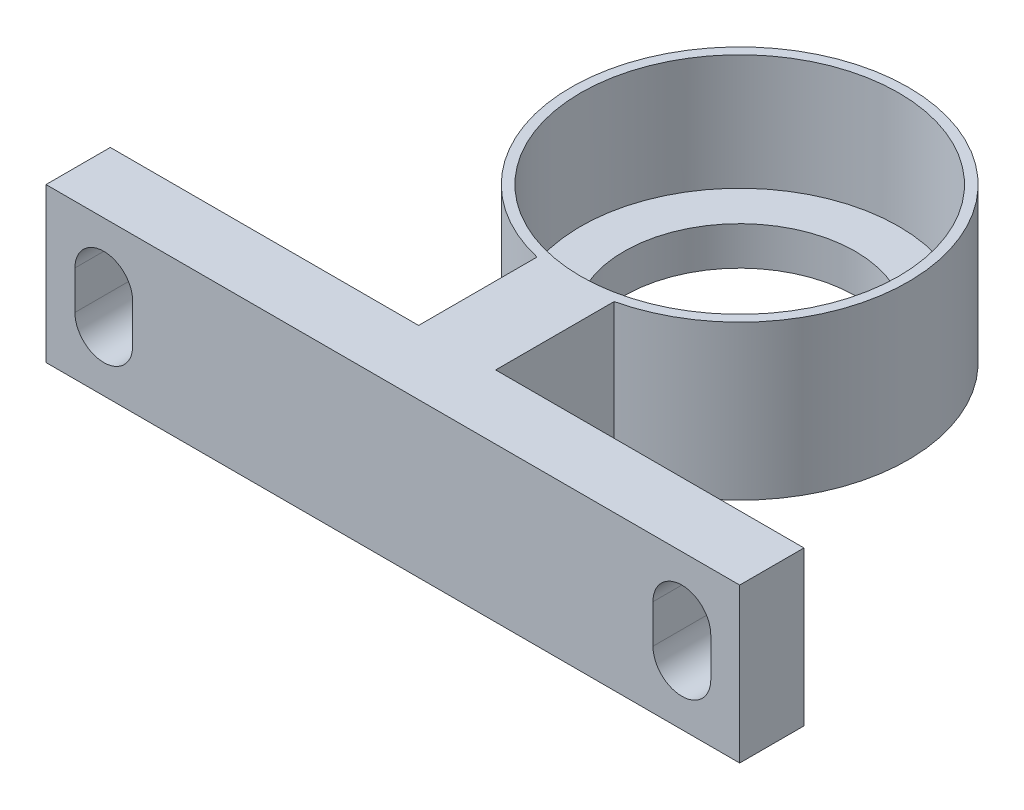
ISO-10303-21;
HEADER;
FILE_DESCRIPTION(('STEP AP214'),'2;1');
FILE_NAME('part.step','',(''),(''),'','','');
FILE_SCHEMA(('AUTOMOTIVE_DESIGN { 1 0 10303 214 1 1 1 1 }'));
ENDSEC;
DATA;
#1=APPLICATION_CONTEXT('core data for automotive mechanical design processes');
#2=APPLICATION_PROTOCOL_DEFINITION('international standard','automotive_design',2000,#1);
#3=PRODUCT_CONTEXT('',#1,'mechanical');
#4=PRODUCT('Part','Part','',(#3));
#5=PRODUCT_RELATED_PRODUCT_CATEGORY('part','',(#4));
#6=PRODUCT_DEFINITION_FORMATION('','',#4);
#7=PRODUCT_DEFINITION_CONTEXT('part definition',#1,'design');
#8=PRODUCT_DEFINITION('design','',#6,#7);
#9=PRODUCT_DEFINITION_SHAPE('','',#8);
#10=(LENGTH_UNIT() NAMED_UNIT(*) SI_UNIT(.MILLI.,.METRE.));
#11=(NAMED_UNIT(*) PLANE_ANGLE_UNIT() SI_UNIT($,.RADIAN.));
#12=(NAMED_UNIT(*) SI_UNIT($,.STERADIAN.) SOLID_ANGLE_UNIT());
#13=UNCERTAINTY_MEASURE_WITH_UNIT(LENGTH_MEASURE(1.E-05),#10,'distance_accuracy_value','');
#14=(GEOMETRIC_REPRESENTATION_CONTEXT(3) GLOBAL_UNCERTAINTY_ASSIGNED_CONTEXT((#13)) GLOBAL_UNIT_ASSIGNED_CONTEXT((#10,
#11,#12)) REPRESENTATION_CONTEXT('',''));
#15=CARTESIAN_POINT('',(0.,0.,0.));
#16=DIRECTION('',(0.,0.,1.));
#17=DIRECTION('',(1.,0.,0.));
#18=AXIS2_PLACEMENT_3D('',#15,#16,#17);
#19=CARTESIAN_POINT('',(27.1849545327589,8.,0.));
#20=DIRECTION('',(0.,-1.,0.));
#21=DIRECTION('',(0.,0.,-1.));
#22=AXIS2_PLACEMENT_3D('',#19,#20,#21);
#23=CYLINDRICAL_SURFACE('',#22,8.75);
#24=DIRECTION('',(0.,-1.,0.));
#25=VECTOR('',#24,1.);
#26=CARTESIAN_POINT('',(29.1849545327589,8.,8.51836251870042));
#27=LINE('',#26,#25);
#28=CARTESIAN_POINT('',(29.1849545327589,8.,8.51836251870042));
#29=VERTEX_POINT('',#28);
#30=CARTESIAN_POINT('',(29.1849545327589,0.,8.51836251870042));
#31=VERTEX_POINT('',#30);
#32=EDGE_CURVE('E245',#29,#31,#27,.T.);
#33=ORIENTED_EDGE('',*,*,#32,.T.);
#34=CARTESIAN_POINT('',(27.1849545327589,0.,0.));
#35=DIRECTION('',(0.,1.,0.));
#36=DIRECTION('',(0.,0.,1.));
#37=AXIS2_PLACEMENT_3D('',#34,#35,#36);
#38=CIRCLE('',#37,8.75);
#39=CARTESIAN_POINT('',(25.1849545327589,0.,8.51836251870042));
#40=VERTEX_POINT('',#39);
#41=EDGE_CURVE('E269',#31,#40,#38,.T.);
#42=ORIENTED_EDGE('',*,*,#41,.T.);
#43=DIRECTION('',(0.,-1.,0.));
#44=VECTOR('',#43,1.);
#45=CARTESIAN_POINT('',(25.1849545327589,8.,8.51836251870042));
#46=LINE('',#45,#44);
#47=CARTESIAN_POINT('',(25.1849545327589,8.,8.51836251870042));
#48=VERTEX_POINT('',#47);
#49=EDGE_CURVE('E242',#48,#40,#46,.T.);
#50=ORIENTED_EDGE('',*,*,#49,.F.);
#51=CARTESIAN_POINT('',(27.1849545327589,8.,0.));
#52=DIRECTION('',(0.,1.,0.));
#53=DIRECTION('',(0.,0.,1.));
#54=AXIS2_PLACEMENT_3D('',#51,#52,#53);
#55=CIRCLE('',#54,8.75);
#56=EDGE_CURVE('E270',#29,#48,#55,.T.);
#57=ORIENTED_EDGE('',*,*,#56,.F.);
#58=EDGE_LOOP('',(#33,#42,#50,#57));
#59=FACE_BOUND('',#58,.T.);
#60=ADVANCED_FACE('F34',(#59),#23,.T.);
#61=CARTESIAN_POINT('',(27.1849545327589,8.,0.));
#62=DIRECTION('',(0.,-1.,0.));
#63=DIRECTION('',(0.,0.,-1.));
#64=AXIS2_PLACEMENT_3D('',#61,#62,#63);
#65=CYLINDRICAL_SURFACE('',#64,8.25);
#66=CARTESIAN_POINT('',(27.1849545327589,8.,0.));
#67=DIRECTION('',(0.,1.,0.));
#68=DIRECTION('',(0.,0.,1.));
#69=AXIS2_PLACEMENT_3D('',#66,#67,#68);
#70=CIRCLE('',#69,8.25);
#71=CARTESIAN_POINT('',(27.1849545327589,8.,8.25));
#72=VERTEX_POINT('',#71);
#73=EDGE_CURVE('E266',#72,#72,#70,.T.);
#74=ORIENTED_EDGE('',*,*,#73,.T.);
#75=EDGE_LOOP('',(#74));
#76=FACE_BOUND('',#75,.T.);
#77=CARTESIAN_POINT('',(27.1849545327589,2.,0.));
#78=DIRECTION('',(0.,-1.,0.));
#79=DIRECTION('',(0.,0.,-1.));
#80=AXIS2_PLACEMENT_3D('',#77,#78,#79);
#81=CIRCLE('',#80,8.25);
#82=CARTESIAN_POINT('',(27.1849545327589,2.,-8.25));
#83=VERTEX_POINT('',#82);
#84=EDGE_CURVE('E261',#83,#83,#81,.T.);
#85=ORIENTED_EDGE('',*,*,#84,.T.);
#86=EDGE_LOOP('',(#85));
#87=FACE_BOUND('',#86,.T.);
#88=ADVANCED_FACE('F301',(#76,#87),#65,.F.);
#89=CARTESIAN_POINT('',(27.1849545327589,8.,0.));
#90=DIRECTION('',(0.,1.,0.));
#91=DIRECTION('',(0.,0.,1.));
#92=AXIS2_PLACEMENT_3D('',#89,#90,#91);
#93=PLANE('',#92);
#94=DIRECTION('',(0.,0.,-1.));
#95=VECTOR('',#94,1.);
#96=CARTESIAN_POINT('',(29.1849545327589,8.,8.51836251870042));
#97=LINE('',#96,#95);
#98=CARTESIAN_POINT('',(29.1849545327589,8.,14.6638678285347));
#99=VERTEX_POINT('',#98);
#100=EDGE_CURVE('E210',#99,#29,#97,.T.);
#101=ORIENTED_EDGE('',*,*,#100,.T.);
#102=ORIENTED_EDGE('',*,*,#56,.T.);
#103=DIRECTION('',(0.,0.,1.));
#104=VECTOR('',#103,1.);
#105=CARTESIAN_POINT('',(25.1849545327589,8.,14.6638678285347));
#106=LINE('',#105,#104);
#107=CARTESIAN_POINT('',(25.1849545327589,8.,14.6638678285347));
#108=VERTEX_POINT('',#107);
#109=EDGE_CURVE('E213',#48,#108,#106,.T.);
#110=ORIENTED_EDGE('',*,*,#109,.T.);
#111=DIRECTION('',(-1.,0.,0.));
#112=VECTOR('',#111,1.);
#113=CARTESIAN_POINT('',(9.18495453275888,8.,14.6638678285347));
#114=LINE('',#113,#112);
#115=CARTESIAN_POINT('',(9.18495453275888,8.,14.6638678285347));
#116=VERTEX_POINT('',#115);
#117=EDGE_CURVE('E215',#108,#116,#114,.T.);
#118=ORIENTED_EDGE('',*,*,#117,.T.);
#119=DIRECTION('',(0.,0.,1.));
#120=VECTOR('',#119,1.);
#121=CARTESIAN_POINT('',(9.18495453275888,8.,18.));
#122=LINE('',#121,#120);
#123=CARTESIAN_POINT('',(9.18495453275888,8.,18.));
#124=VERTEX_POINT('',#123);
#125=EDGE_CURVE('E217',#116,#124,#122,.T.);
#126=ORIENTED_EDGE('',*,*,#125,.T.);
#127=DIRECTION('',(1.,0.,0.));
#128=VECTOR('',#127,1.);
#129=CARTESIAN_POINT('',(27.1849545327589,8.,18.));
#130=LINE('',#129,#128);
#131=CARTESIAN_POINT('',(45.1849545327589,8.,18.));
#132=VERTEX_POINT('',#131);
#133=EDGE_CURVE('E203',#124,#132,#130,.T.);
#134=ORIENTED_EDGE('',*,*,#133,.T.);
#135=DIRECTION('',(0.,0.,-1.));
#136=VECTOR('',#135,1.);
#137=CARTESIAN_POINT('',(45.1849545327589,8.,18.));
#138=LINE('',#137,#136);
#139=CARTESIAN_POINT('',(45.1849545327589,8.,14.6638678285347));
#140=VERTEX_POINT('',#139);
#141=EDGE_CURVE('E205',#132,#140,#138,.T.);
#142=ORIENTED_EDGE('',*,*,#141,.T.);
#143=DIRECTION('',(-1.,0.,0.));
#144=VECTOR('',#143,1.);
#145=CARTESIAN_POINT('',(45.1849545327589,8.,14.6638678285347));
#146=LINE('',#145,#144);
#147=EDGE_CURVE('E208',#140,#99,#146,.T.);
#148=ORIENTED_EDGE('',*,*,#147,.T.);
#149=EDGE_LOOP('',(#101,#102,#110,#118,#126,#134,#142,#148));
#150=FACE_BOUND('',#149,.T.);
#151=ORIENTED_EDGE('',*,*,#73,.F.);
#152=EDGE_LOOP('',(#151));
#153=FACE_BOUND('',#152,.T.);
#154=ADVANCED_FACE('F306',(#150,#153),#93,.T.);
#155=CARTESIAN_POINT('',(27.1849545327589,0.,0.));
#156=DIRECTION('',(0.,1.,0.));
#157=DIRECTION('',(0.,0.,1.));
#158=AXIS2_PLACEMENT_3D('',#155,#156,#157);
#159=PLANE('',#158);
#160=DIRECTION('',(0.,0.,1.));
#161=VECTOR('',#160,1.);
#162=CARTESIAN_POINT('',(25.1849545327589,0.,14.6638678285347));
#163=LINE('',#162,#161);
#164=CARTESIAN_POINT('',(25.1849545327589,0.,14.6638678285347));
#165=VERTEX_POINT('',#164);
#166=EDGE_CURVE('E228',#40,#165,#163,.T.);
#167=ORIENTED_EDGE('',*,*,#166,.F.);
#168=ORIENTED_EDGE('',*,*,#41,.F.);
#169=DIRECTION('',(0.,0.,-1.));
#170=VECTOR('',#169,1.);
#171=CARTESIAN_POINT('',(29.1849545327589,0.,8.51836251870042));
#172=LINE('',#171,#170);
#173=CARTESIAN_POINT('',(29.1849545327589,0.,14.6638678285347));
#174=VERTEX_POINT('',#173);
#175=EDGE_CURVE('E225',#174,#31,#172,.T.);
#176=ORIENTED_EDGE('',*,*,#175,.F.);
#177=DIRECTION('',(-1.,0.,0.));
#178=VECTOR('',#177,1.);
#179=CARTESIAN_POINT('',(45.1849545327589,0.,14.6638678285347));
#180=LINE('',#179,#178);
#181=CARTESIAN_POINT('',(45.1849545327589,0.,14.6638678285347));
#182=VERTEX_POINT('',#181);
#183=EDGE_CURVE('E223',#182,#174,#180,.T.);
#184=ORIENTED_EDGE('',*,*,#183,.F.);
#185=DIRECTION('',(0.,0.,-1.));
#186=VECTOR('',#185,1.);
#187=CARTESIAN_POINT('',(45.1849545327589,0.,18.));
#188=LINE('',#187,#186);
#189=CARTESIAN_POINT('',(45.1849545327589,0.,18.));
#190=VERTEX_POINT('',#189);
#191=EDGE_CURVE('E221',#190,#182,#188,.T.);
#192=ORIENTED_EDGE('',*,*,#191,.F.);
#193=DIRECTION('',(1.,0.,0.));
#194=VECTOR('',#193,1.);
#195=CARTESIAN_POINT('',(27.1849545327589,0.,18.));
#196=LINE('',#195,#194);
#197=CARTESIAN_POINT('',(9.18495453275888,0.,18.));
#198=VERTEX_POINT('',#197);
#199=EDGE_CURVE('E202',#198,#190,#196,.T.);
#200=ORIENTED_EDGE('',*,*,#199,.F.);
#201=DIRECTION('',(0.,0.,1.));
#202=VECTOR('',#201,1.);
#203=CARTESIAN_POINT('',(9.18495453275888,0.,18.));
#204=LINE('',#203,#202);
#205=CARTESIAN_POINT('',(9.18495453275888,0.,14.6638678285347));
#206=VERTEX_POINT('',#205);
#207=EDGE_CURVE('E206',#206,#198,#204,.T.);
#208=ORIENTED_EDGE('',*,*,#207,.F.);
#209=DIRECTION('',(-1.,0.,0.));
#210=VECTOR('',#209,1.);
#211=CARTESIAN_POINT('',(9.18495453275888,0.,14.6638678285347));
#212=LINE('',#211,#210);
#213=EDGE_CURVE('E230',#165,#206,#212,.T.);
#214=ORIENTED_EDGE('',*,*,#213,.F.);
#215=EDGE_LOOP('',(#167,#168,#176,#184,#192,#200,#208,#214));
#216=FACE_BOUND('',#215,.T.);
#217=CARTESIAN_POINT('',(27.1849545327589,0.,0.));
#218=DIRECTION('',(0.,-1.,0.));
#219=DIRECTION('',(0.,0.,-1.));
#220=AXIS2_PLACEMENT_3D('',#217,#218,#219);
#221=CIRCLE('',#220,6.);
#222=CARTESIAN_POINT('',(27.1849545327589,0.,-6.));
#223=VERTEX_POINT('',#222);
#224=EDGE_CURVE('E257',#223,#223,#221,.T.);
#225=ORIENTED_EDGE('',*,*,#224,.F.);
#226=EDGE_LOOP('',(#225));
#227=FACE_BOUND('',#226,.T.);
#228=ADVANCED_FACE('F318',(#216,#227),#159,.F.);
#229=CARTESIAN_POINT('',(27.1849545327589,2.,0.));
#230=DIRECTION('',(0.,-1.,0.));
#231=DIRECTION('',(0.,0.,-1.));
#232=AXIS2_PLACEMENT_3D('',#229,#230,#231);
#233=PLANE('',#232);
#234=CARTESIAN_POINT('',(27.1849545327589,2.,0.));
#235=DIRECTION('',(0.,-1.,0.));
#236=DIRECTION('',(0.,0.,-1.));
#237=AXIS2_PLACEMENT_3D('',#234,#235,#236);
#238=CIRCLE('',#237,6.);
#239=CARTESIAN_POINT('',(27.1849545327589,2.,-6.));
#240=VERTEX_POINT('',#239);
#241=EDGE_CURVE('E258',#240,#240,#238,.T.);
#242=ORIENTED_EDGE('',*,*,#241,.T.);
#243=EDGE_LOOP('',(#242));
#244=FACE_BOUND('',#243,.T.);
#245=ORIENTED_EDGE('',*,*,#84,.F.);
#246=EDGE_LOOP('',(#245));
#247=FACE_BOUND('',#246,.T.);
#248=ADVANCED_FACE('F353',(#244,#247),#233,.F.);
#249=CARTESIAN_POINT('',(27.1849545327589,2.,0.));
#250=DIRECTION('',(0.,-1.,0.));
#251=DIRECTION('',(0.,0.,-1.));
#252=AXIS2_PLACEMENT_3D('',#249,#250,#251);
#253=CYLINDRICAL_SURFACE('',#252,6.);
#254=ORIENTED_EDGE('',*,*,#241,.F.);
#255=EDGE_LOOP('',(#254));
#256=FACE_BOUND('',#255,.T.);
#257=ORIENTED_EDGE('',*,*,#224,.T.);
#258=EDGE_LOOP('',(#257));
#259=FACE_BOUND('',#258,.T.);
#260=ADVANCED_FACE('F346',(#256,#259),#253,.F.);
#261=CARTESIAN_POINT('',(27.1849545327589,8.,18.));
#262=DIRECTION('',(0.,0.,-1.));
#263=DIRECTION('',(-1.,0.,0.));
#264=AXIS2_PLACEMENT_3D('',#261,#262,#263);
#265=PLANE('',#264);
#266=CARTESIAN_POINT('',(42.1849545327589,3.,18.));
#267=DIRECTION('',(0.,0.,1.));
#268=DIRECTION('',(1.,0.,0.));
#269=AXIS2_PLACEMENT_3D('',#266,#267,#268);
#270=CIRCLE('',#269,1.5);
#271=CARTESIAN_POINT('',(40.6849545327589,3.,18.));
#272=VERTEX_POINT('',#271);
#273=CARTESIAN_POINT('',(43.6849545327589,3.,18.));
#274=VERTEX_POINT('',#273);
#275=EDGE_CURVE('E157',#272,#274,#270,.T.);
#276=ORIENTED_EDGE('',*,*,#275,.F.);
#277=DIRECTION('',(0.,-1.,0.));
#278=VECTOR('',#277,1.);
#279=CARTESIAN_POINT('',(40.6849545327589,4.,18.));
#280=LINE('',#279,#278);
#281=CARTESIAN_POINT('',(40.6849545327589,5.,18.));
#282=VERTEX_POINT('',#281);
#283=EDGE_CURVE('E48',#282,#272,#280,.T.);
#284=ORIENTED_EDGE('',*,*,#283,.F.);
#285=CARTESIAN_POINT('',(42.1849545327589,5.,18.));
#286=DIRECTION('',(0.,0.,1.));
#287=DIRECTION('',(1.,0.,0.));
#288=AXIS2_PLACEMENT_3D('',#285,#286,#287);
#289=CIRCLE('',#288,1.5);
#290=CARTESIAN_POINT('',(43.6849545327589,5.,18.));
#291=VERTEX_POINT('',#290);
#292=EDGE_CURVE('E165',#291,#282,#289,.T.);
#293=ORIENTED_EDGE('',*,*,#292,.F.);
#294=DIRECTION('',(0.,1.,0.));
#295=VECTOR('',#294,1.);
#296=CARTESIAN_POINT('',(43.6849545327589,5.,18.));
#297=LINE('',#296,#295);
#298=EDGE_CURVE('E149',#274,#291,#297,.T.);
#299=ORIENTED_EDGE('',*,*,#298,.F.);
#300=EDGE_LOOP('',(#276,#284,#293,#299));
#301=FACE_BOUND('',#300,.T.);
#302=CARTESIAN_POINT('',(12.1849545327589,3.,18.));
#303=DIRECTION('',(0.,0.,1.));
#304=DIRECTION('',(1.,0.,0.));
#305=AXIS2_PLACEMENT_3D('',#302,#303,#304);
#306=CIRCLE('',#305,1.5);
#307=CARTESIAN_POINT('',(10.6849545327589,3.,18.));
#308=VERTEX_POINT('',#307);
#309=CARTESIAN_POINT('',(13.6849545327589,3.,18.));
#310=VERTEX_POINT('',#309);
#311=EDGE_CURVE('E177',#308,#310,#306,.T.);
#312=ORIENTED_EDGE('',*,*,#311,.F.);
#313=DIRECTION('',(0.,-1.,0.));
#314=VECTOR('',#313,1.);
#315=CARTESIAN_POINT('',(10.6849545327589,4.,18.));
#316=LINE('',#315,#314);
#317=CARTESIAN_POINT('',(10.6849545327589,5.,18.));
#318=VERTEX_POINT('',#317);
#319=EDGE_CURVE('E185',#318,#308,#316,.T.);
#320=ORIENTED_EDGE('',*,*,#319,.F.);
#321=CARTESIAN_POINT('',(12.1849545327589,5.,18.));
#322=DIRECTION('',(0.,0.,1.));
#323=DIRECTION('',(1.,0.,0.));
#324=AXIS2_PLACEMENT_3D('',#321,#322,#323);
#325=CIRCLE('',#324,1.5);
#326=CARTESIAN_POINT('',(13.6849545327589,5.,18.));
#327=VERTEX_POINT('',#326);
#328=EDGE_CURVE('E182',#327,#318,#325,.T.);
#329=ORIENTED_EDGE('',*,*,#328,.F.);
#330=DIRECTION('',(0.,1.,0.));
#331=VECTOR('',#330,1.);
#332=CARTESIAN_POINT('',(13.6849545327589,4.,18.));
#333=LINE('',#332,#331);
#334=EDGE_CURVE('E180',#310,#327,#333,.T.);
#335=ORIENTED_EDGE('',*,*,#334,.F.);
#336=EDGE_LOOP('',(#312,#320,#329,#335));
#337=FACE_BOUND('',#336,.T.);
#338=ORIENTED_EDGE('',*,*,#199,.T.);
#339=DIRECTION('',(0.,-1.,0.));
#340=VECTOR('',#339,1.);
#341=CARTESIAN_POINT('',(45.1849545327589,8.,18.));
#342=LINE('',#341,#340);
#343=EDGE_CURVE('E254',#132,#190,#342,.T.);
#344=ORIENTED_EDGE('',*,*,#343,.F.);
#345=ORIENTED_EDGE('',*,*,#133,.F.);
#346=DIRECTION('',(0.,-1.,0.));
#347=VECTOR('',#346,1.);
#348=CARTESIAN_POINT('',(9.18495453275888,8.,18.));
#349=LINE('',#348,#347);
#350=EDGE_CURVE('E219',#124,#198,#349,.T.);
#351=ORIENTED_EDGE('',*,*,#350,.T.);
#352=EDGE_LOOP('',(#338,#344,#345,#351));
#353=FACE_BOUND('',#352,.T.);
#354=ADVANCED_FACE('F162',(#301,#337,#353),#265,.F.);
#355=CARTESIAN_POINT('',(45.1849545327589,8.,18.));
#356=DIRECTION('',(-1.,0.,0.));
#357=DIRECTION('',(0.,0.,1.));
#358=AXIS2_PLACEMENT_3D('',#355,#356,#357);
#359=PLANE('',#358);
#360=ORIENTED_EDGE('',*,*,#191,.T.);
#361=DIRECTION('',(0.,-1.,0.));
#362=VECTOR('',#361,1.);
#363=CARTESIAN_POINT('',(45.1849545327589,8.,14.6638678285347));
#364=LINE('',#363,#362);
#365=EDGE_CURVE('E251',#140,#182,#364,.T.);
#366=ORIENTED_EDGE('',*,*,#365,.F.);
#367=ORIENTED_EDGE('',*,*,#141,.F.);
#368=ORIENTED_EDGE('',*,*,#343,.T.);
#369=EDGE_LOOP('',(#360,#366,#367,#368));
#370=FACE_BOUND('',#369,.T.);
#371=ADVANCED_FACE('F339',(#370),#359,.F.);
#372=CARTESIAN_POINT('',(45.1849545327589,8.,14.6638678285347));
#373=DIRECTION('',(0.,0.,1.));
#374=DIRECTION('',(1.,0.,0.));
#375=AXIS2_PLACEMENT_3D('',#372,#373,#374);
#376=PLANE('',#375);
#377=DIRECTION('',(0.,1.,0.));
#378=VECTOR('',#377,1.);
#379=CARTESIAN_POINT('',(43.6849545327589,8.,14.6638678285347));
#380=LINE('',#379,#378);
#381=CARTESIAN_POINT('',(43.6849545327589,3.,14.6638678285347));
#382=VERTEX_POINT('',#381);
#383=CARTESIAN_POINT('',(43.6849545327589,5.,14.6638678285347));
#384=VERTEX_POINT('',#383);
#385=EDGE_CURVE('E151',#382,#384,#380,.T.);
#386=ORIENTED_EDGE('',*,*,#385,.T.);
#387=CARTESIAN_POINT('',(42.1849545327589,5.,14.6638678285347));
#388=DIRECTION('',(0.,0.,1.));
#389=DIRECTION('',(1.,0.,0.));
#390=AXIS2_PLACEMENT_3D('',#387,#388,#389);
#391=CIRCLE('',#390,1.5);
#392=CARTESIAN_POINT('',(40.6849545327589,5.,14.6638678285347));
#393=VERTEX_POINT('',#392);
#394=EDGE_CURVE('E11',#384,#393,#391,.T.);
#395=ORIENTED_EDGE('',*,*,#394,.T.);
#396=DIRECTION('',(0.,-1.,0.));
#397=VECTOR('',#396,1.);
#398=CARTESIAN_POINT('',(40.6849545327589,8.,14.6638678285347));
#399=LINE('',#398,#397);
#400=CARTESIAN_POINT('',(40.6849545327589,3.,14.6638678285347));
#401=VERTEX_POINT('',#400);
#402=EDGE_CURVE('E175',#393,#401,#399,.T.);
#403=ORIENTED_EDGE('',*,*,#402,.T.);
#404=CARTESIAN_POINT('',(42.1849545327589,3.,14.6638678285347));
#405=DIRECTION('',(0.,0.,1.));
#406=DIRECTION('',(1.,0.,0.));
#407=AXIS2_PLACEMENT_3D('',#404,#405,#406);
#408=CIRCLE('',#407,1.5);
#409=EDGE_CURVE('E41',#401,#382,#408,.T.);
#410=ORIENTED_EDGE('',*,*,#409,.T.);
#411=EDGE_LOOP('',(#386,#395,#403,#410));
#412=FACE_BOUND('',#411,.T.);
#413=ORIENTED_EDGE('',*,*,#183,.T.);
#414=DIRECTION('',(0.,-1.,0.));
#415=VECTOR('',#414,1.);
#416=CARTESIAN_POINT('',(29.1849545327589,8.,14.6638678285347));
#417=LINE('',#416,#415);
#418=EDGE_CURVE('E248',#99,#174,#417,.T.);
#419=ORIENTED_EDGE('',*,*,#418,.F.);
#420=ORIENTED_EDGE('',*,*,#147,.F.);
#421=ORIENTED_EDGE('',*,*,#365,.T.);
#422=EDGE_LOOP('',(#413,#419,#420,#421));
#423=FACE_BOUND('',#422,.T.);
#424=ADVANCED_FACE('F280',(#412,#423),#376,.F.);
#425=CARTESIAN_POINT('',(29.1849545327589,8.,8.51836251870042));
#426=DIRECTION('',(-1.,0.,0.));
#427=DIRECTION('',(0.,0.,1.));
#428=AXIS2_PLACEMENT_3D('',#425,#426,#427);
#429=PLANE('',#428);
#430=ORIENTED_EDGE('',*,*,#175,.T.);
#431=ORIENTED_EDGE('',*,*,#32,.F.);
#432=ORIENTED_EDGE('',*,*,#100,.F.);
#433=ORIENTED_EDGE('',*,*,#418,.T.);
#434=EDGE_LOOP('',(#430,#431,#432,#433));
#435=FACE_BOUND('',#434,.T.);
#436=ADVANCED_FACE('F313',(#435),#429,.F.);
#437=CARTESIAN_POINT('',(25.1849545327589,8.,14.6638678285347));
#438=DIRECTION('',(1.,0.,0.));
#439=DIRECTION('',(0.,0.,-1.));
#440=AXIS2_PLACEMENT_3D('',#437,#438,#439);
#441=PLANE('',#440);
#442=ORIENTED_EDGE('',*,*,#166,.T.);
#443=DIRECTION('',(0.,-1.,0.));
#444=VECTOR('',#443,1.);
#445=CARTESIAN_POINT('',(25.1849545327589,8.,14.6638678285347));
#446=LINE('',#445,#444);
#447=EDGE_CURVE('E239',#108,#165,#446,.T.);
#448=ORIENTED_EDGE('',*,*,#447,.F.);
#449=ORIENTED_EDGE('',*,*,#109,.F.);
#450=ORIENTED_EDGE('',*,*,#49,.T.);
#451=EDGE_LOOP('',(#442,#448,#449,#450));
#452=FACE_BOUND('',#451,.T.);
#453=ADVANCED_FACE('F325',(#452),#441,.F.);
#454=CARTESIAN_POINT('',(9.18495453275888,8.,14.6638678285347));
#455=DIRECTION('',(0.,0.,1.));
#456=DIRECTION('',(1.,0.,0.));
#457=AXIS2_PLACEMENT_3D('',#454,#455,#456);
#458=PLANE('',#457);
#459=DIRECTION('',(0.,1.,0.));
#460=VECTOR('',#459,1.);
#461=CARTESIAN_POINT('',(13.6849545327589,8.,14.6638678285347));
#462=LINE('',#461,#460);
#463=CARTESIAN_POINT('',(13.6849545327589,3.,14.6638678285347));
#464=VERTEX_POINT('',#463);
#465=CARTESIAN_POINT('',(13.6849545327589,5.,14.6638678285347));
#466=VERTEX_POINT('',#465);
#467=EDGE_CURVE('E191',#464,#466,#462,.T.);
#468=ORIENTED_EDGE('',*,*,#467,.T.);
#469=CARTESIAN_POINT('',(12.1849545327589,5.,14.6638678285347));
#470=DIRECTION('',(0.,0.,1.));
#471=DIRECTION('',(1.,0.,0.));
#472=AXIS2_PLACEMENT_3D('',#469,#470,#471);
#473=CIRCLE('',#472,1.5);
#474=CARTESIAN_POINT('',(10.6849545327589,5.,14.6638678285347));
#475=VERTEX_POINT('',#474);
#476=EDGE_CURVE('E277',#466,#475,#473,.T.);
#477=ORIENTED_EDGE('',*,*,#476,.T.);
#478=DIRECTION('',(0.,-1.,0.));
#479=VECTOR('',#478,1.);
#480=CARTESIAN_POINT('',(10.6849545327589,8.,14.6638678285347));
#481=LINE('',#480,#479);
#482=CARTESIAN_POINT('',(10.6849545327589,3.,14.6638678285347));
#483=VERTEX_POINT('',#482);
#484=EDGE_CURVE('E200',#475,#483,#481,.T.);
#485=ORIENTED_EDGE('',*,*,#484,.T.);
#486=CARTESIAN_POINT('',(12.1849545327589,3.,14.6638678285347));
#487=DIRECTION('',(0.,0.,1.));
#488=DIRECTION('',(1.,0.,0.));
#489=AXIS2_PLACEMENT_3D('',#486,#487,#488);
#490=CIRCLE('',#489,1.5);
#491=EDGE_CURVE('E273',#483,#464,#490,.T.);
#492=ORIENTED_EDGE('',*,*,#491,.T.);
#493=EDGE_LOOP('',(#468,#477,#485,#492));
#494=FACE_BOUND('',#493,.T.);
#495=ORIENTED_EDGE('',*,*,#213,.T.);
#496=DIRECTION('',(0.,-1.,0.));
#497=VECTOR('',#496,1.);
#498=CARTESIAN_POINT('',(9.18495453275888,8.,14.6638678285347));
#499=LINE('',#498,#497);
#500=EDGE_CURVE('E236',#116,#206,#499,.T.);
#501=ORIENTED_EDGE('',*,*,#500,.F.);
#502=ORIENTED_EDGE('',*,*,#117,.F.);
#503=ORIENTED_EDGE('',*,*,#447,.T.);
#504=EDGE_LOOP('',(#495,#501,#502,#503));
#505=FACE_BOUND('',#504,.T.);
#506=ADVANCED_FACE('F329',(#494,#505),#458,.F.);
#507=CARTESIAN_POINT('',(9.18495453275888,8.,18.));
#508=DIRECTION('',(1.,0.,0.));
#509=DIRECTION('',(0.,0.,-1.));
#510=AXIS2_PLACEMENT_3D('',#507,#508,#509);
#511=PLANE('',#510);
#512=ORIENTED_EDGE('',*,*,#207,.T.);
#513=ORIENTED_EDGE('',*,*,#350,.F.);
#514=ORIENTED_EDGE('',*,*,#125,.F.);
#515=ORIENTED_EDGE('',*,*,#500,.T.);
#516=EDGE_LOOP('',(#512,#513,#514,#515));
#517=FACE_BOUND('',#516,.T.);
#518=ADVANCED_FACE('F343',(#517),#511,.F.);
#519=CARTESIAN_POINT('',(12.1849545327589,5.,10.));
#520=DIRECTION('',(0.,0.,1.));
#521=DIRECTION('',(1.,0.,0.));
#522=AXIS2_PLACEMENT_3D('',#519,#520,#521);
#523=CYLINDRICAL_SURFACE('',#522,1.5);
#524=DIRECTION('',(0.,0.,1.));
#525=VECTOR('',#524,1.);
#526=CARTESIAN_POINT('',(13.6849545327589,5.,10.));
#527=LINE('',#526,#525);
#528=EDGE_CURVE('E192',#466,#327,#527,.T.);
#529=ORIENTED_EDGE('',*,*,#528,.T.);
#530=ORIENTED_EDGE('',*,*,#328,.T.);
#531=DIRECTION('',(0.,0.,1.));
#532=VECTOR('',#531,1.);
#533=CARTESIAN_POINT('',(10.6849545327589,5.,10.));
#534=LINE('',#533,#532);
#535=EDGE_CURVE('E188',#475,#318,#534,.T.);
#536=ORIENTED_EDGE('',*,*,#535,.F.);
#537=ORIENTED_EDGE('',*,*,#476,.F.);
#538=EDGE_LOOP('',(#529,#530,#536,#537));
#539=FACE_BOUND('',#538,.T.);
#540=ADVANCED_FACE('F446',(#539),#523,.F.);
#541=CARTESIAN_POINT('',(12.1849545327589,3.,10.));
#542=DIRECTION('',(0.,0.,1.));
#543=DIRECTION('',(1.,0.,0.));
#544=AXIS2_PLACEMENT_3D('',#541,#542,#543);
#545=CYLINDRICAL_SURFACE('',#544,1.5);
#546=DIRECTION('',(0.,0.,1.));
#547=VECTOR('',#546,1.);
#548=CARTESIAN_POINT('',(10.6849545327589,3.,10.));
#549=LINE('',#548,#547);
#550=EDGE_CURVE('E187',#483,#308,#549,.T.);
#551=ORIENTED_EDGE('',*,*,#550,.T.);
#552=ORIENTED_EDGE('',*,*,#311,.T.);
#553=DIRECTION('',(0.,0.,1.));
#554=VECTOR('',#553,1.);
#555=CARTESIAN_POINT('',(13.6849545327589,3.,10.));
#556=LINE('',#555,#554);
#557=EDGE_CURVE('E195',#464,#310,#556,.T.);
#558=ORIENTED_EDGE('',*,*,#557,.F.);
#559=ORIENTED_EDGE('',*,*,#491,.F.);
#560=EDGE_LOOP('',(#551,#552,#558,#559));
#561=FACE_BOUND('',#560,.T.);
#562=ADVANCED_FACE('F453',(#561),#545,.F.);
#563=CARTESIAN_POINT('',(10.6849545327589,4.,10.));
#564=DIRECTION('',(-1.,0.,0.));
#565=DIRECTION('',(0.,0.,1.));
#566=AXIS2_PLACEMENT_3D('',#563,#564,#565);
#567=PLANE('',#566);
#568=ORIENTED_EDGE('',*,*,#535,.T.);
#569=ORIENTED_EDGE('',*,*,#319,.T.);
#570=ORIENTED_EDGE('',*,*,#550,.F.);
#571=ORIENTED_EDGE('',*,*,#484,.F.);
#572=EDGE_LOOP('',(#568,#569,#570,#571));
#573=FACE_BOUND('',#572,.T.);
#574=ADVANCED_FACE('F295',(#573),#567,.F.);
#575=CARTESIAN_POINT('',(13.6849545327589,4.,10.));
#576=DIRECTION('',(1.,0.,0.));
#577=DIRECTION('',(0.,0.,-1.));
#578=AXIS2_PLACEMENT_3D('',#575,#576,#577);
#579=PLANE('',#578);
#580=ORIENTED_EDGE('',*,*,#557,.T.);
#581=ORIENTED_EDGE('',*,*,#334,.T.);
#582=ORIENTED_EDGE('',*,*,#528,.F.);
#583=ORIENTED_EDGE('',*,*,#467,.F.);
#584=EDGE_LOOP('',(#580,#581,#582,#583));
#585=FACE_BOUND('',#584,.T.);
#586=ADVANCED_FACE('F288',(#585),#579,.F.);
#587=CARTESIAN_POINT('',(42.1849545327589,5.,10.));
#588=DIRECTION('',(0.,0.,1.));
#589=DIRECTION('',(1.,0.,0.));
#590=AXIS2_PLACEMENT_3D('',#587,#588,#589);
#591=CYLINDRICAL_SURFACE('',#590,1.5);
#592=DIRECTION('',(0.,0.,1.));
#593=VECTOR('',#592,1.);
#594=CARTESIAN_POINT('',(43.6849545327589,5.,10.));
#595=LINE('',#594,#593);
#596=EDGE_CURVE('E153',#384,#291,#595,.T.);
#597=ORIENTED_EDGE('',*,*,#596,.T.);
#598=ORIENTED_EDGE('',*,*,#292,.T.);
#599=DIRECTION('',(0.,0.,1.));
#600=VECTOR('',#599,1.);
#601=CARTESIAN_POINT('',(40.6849545327589,5.,10.));
#602=LINE('',#601,#600);
#603=EDGE_CURVE('E170',#393,#282,#602,.T.);
#604=ORIENTED_EDGE('',*,*,#603,.F.);
#605=ORIENTED_EDGE('',*,*,#394,.F.);
#606=EDGE_LOOP('',(#597,#598,#604,#605));
#607=FACE_BOUND('',#606,.T.);
#608=ADVANCED_FACE('F286',(#607),#591,.F.);
#609=CARTESIAN_POINT('',(42.1849545327589,3.,10.));
#610=DIRECTION('',(0.,0.,1.));
#611=DIRECTION('',(1.,0.,0.));
#612=AXIS2_PLACEMENT_3D('',#609,#610,#611);
#613=CYLINDRICAL_SURFACE('',#612,1.5);
#614=DIRECTION('',(0.,0.,1.));
#615=VECTOR('',#614,1.);
#616=CARTESIAN_POINT('',(40.6849545327589,3.,10.));
#617=LINE('',#616,#615);
#618=EDGE_CURVE('E154',#401,#272,#617,.T.);
#619=ORIENTED_EDGE('',*,*,#618,.T.);
#620=ORIENTED_EDGE('',*,*,#275,.T.);
#621=DIRECTION('',(0.,0.,1.));
#622=VECTOR('',#621,1.);
#623=CARTESIAN_POINT('',(43.6849545327589,3.,10.));
#624=LINE('',#623,#622);
#625=EDGE_CURVE('E56',#382,#274,#624,.T.);
#626=ORIENTED_EDGE('',*,*,#625,.F.);
#627=ORIENTED_EDGE('',*,*,#409,.F.);
#628=EDGE_LOOP('',(#619,#620,#626,#627));
#629=FACE_BOUND('',#628,.T.);
#630=ADVANCED_FACE('F158',(#629),#613,.F.);
#631=CARTESIAN_POINT('',(40.6849545327589,4.,10.));
#632=DIRECTION('',(-1.,0.,0.));
#633=DIRECTION('',(0.,0.,1.));
#634=AXIS2_PLACEMENT_3D('',#631,#632,#633);
#635=PLANE('',#634);
#636=ORIENTED_EDGE('',*,*,#603,.T.);
#637=ORIENTED_EDGE('',*,*,#283,.T.);
#638=ORIENTED_EDGE('',*,*,#618,.F.);
#639=ORIENTED_EDGE('',*,*,#402,.F.);
#640=EDGE_LOOP('',(#636,#637,#638,#639));
#641=FACE_BOUND('',#640,.T.);
#642=ADVANCED_FACE('F283',(#641),#635,.F.);
#643=CARTESIAN_POINT('',(43.6849545327589,5.,10.));
#644=DIRECTION('',(1.,0.,0.));
#645=DIRECTION('',(0.,0.,-1.));
#646=AXIS2_PLACEMENT_3D('',#643,#644,#645);
#647=PLANE('',#646);
#648=ORIENTED_EDGE('',*,*,#625,.T.);
#649=ORIENTED_EDGE('',*,*,#298,.T.);
#650=ORIENTED_EDGE('',*,*,#596,.F.);
#651=ORIENTED_EDGE('',*,*,#385,.F.);
#652=EDGE_LOOP('',(#648,#649,#650,#651));
#653=FACE_BOUND('',#652,.T.);
#654=ADVANCED_FACE('F146',(#653),#647,.F.);
#655=CLOSED_SHELL('',(#60,#88,#154,#228,#248,#260,#354,#371,#424,#436,#453,#506,#518,#540,#562,
#574,#586,#608,#630,#642,#654));
#656=MANIFOLD_SOLID_BREP('B2',#655);
#657=ADVANCED_BREP_SHAPE_REPRESENTATION('',(#18,#656),#14);
#658=SHAPE_DEFINITION_REPRESENTATION(#9,#657);
ENDSEC;
END-ISO-10303-21;
